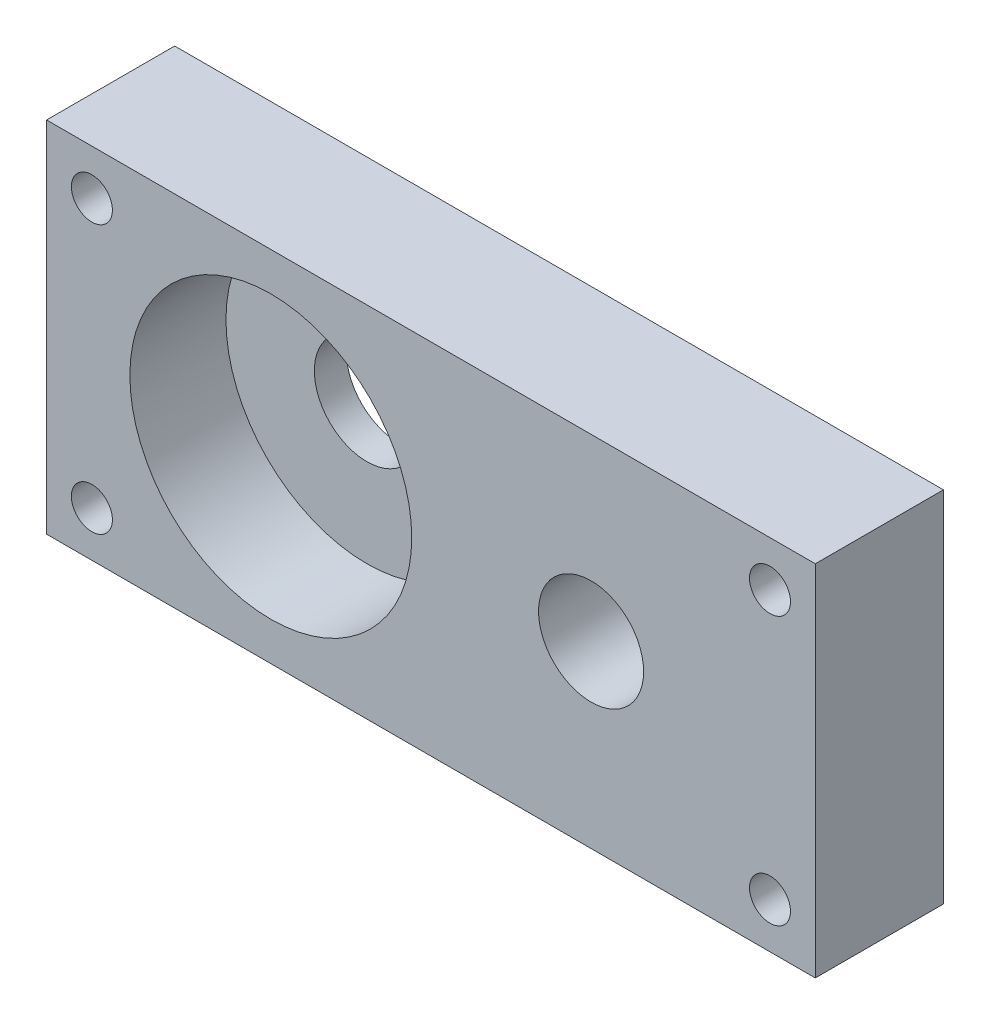
ISO-10303-21;
HEADER;
FILE_DESCRIPTION(('STEP AP214'),'2;1');
FILE_NAME('part.step','',(''),(''),'','','');
FILE_SCHEMA(('AUTOMOTIVE_DESIGN { 1 0 10303 214 1 1 1 1 }'));
ENDSEC;
DATA;
#1=APPLICATION_CONTEXT('core data for automotive mechanical design processes');
#2=APPLICATION_PROTOCOL_DEFINITION('international standard','automotive_design',2000,#1);
#3=PRODUCT_CONTEXT('',#1,'mechanical');
#4=PRODUCT('Part','Part','',(#3));
#5=PRODUCT_RELATED_PRODUCT_CATEGORY('part','',(#4));
#6=PRODUCT_DEFINITION_FORMATION('','',#4);
#7=PRODUCT_DEFINITION_CONTEXT('part definition',#1,'design');
#8=PRODUCT_DEFINITION('design','',#6,#7);
#9=PRODUCT_DEFINITION_SHAPE('','',#8);
#10=(LENGTH_UNIT() NAMED_UNIT(*) SI_UNIT(.MILLI.,.METRE.));
#11=(NAMED_UNIT(*) PLANE_ANGLE_UNIT() SI_UNIT($,.RADIAN.));
#12=(NAMED_UNIT(*) SI_UNIT($,.STERADIAN.) SOLID_ANGLE_UNIT());
#13=UNCERTAINTY_MEASURE_WITH_UNIT(LENGTH_MEASURE(1.E-05),#10,'distance_accuracy_value','');
#14=(GEOMETRIC_REPRESENTATION_CONTEXT(3) GLOBAL_UNCERTAINTY_ASSIGNED_CONTEXT((#13)) GLOBAL_UNIT_ASSIGNED_CONTEXT((#10,
#11,#12)) REPRESENTATION_CONTEXT('',''));
#15=CARTESIAN_POINT('',(0.,0.,0.));
#16=DIRECTION('',(0.,0.,1.));
#17=DIRECTION('',(1.,0.,0.));
#18=AXIS2_PLACEMENT_3D('',#15,#16,#17);
#19=CARTESIAN_POINT('',(-12.5,0.,10.));
#20=DIRECTION('',(0.,0.,-1.));
#21=DIRECTION('',(-1.,0.,0.));
#22=AXIS2_PLACEMENT_3D('',#19,#20,#21);
#23=CYLINDRICAL_SURFACE('',#22,4.1);
#24=CARTESIAN_POINT('',(-12.5,0.,0.));
#25=DIRECTION('',(0.,0.,1.));
#26=DIRECTION('',(1.,0.,0.));
#27=AXIS2_PLACEMENT_3D('',#24,#25,#26);
#28=CIRCLE('',#27,4.1);
#29=CARTESIAN_POINT('',(-8.4,0.,0.));
#30=VERTEX_POINT('',#29);
#31=EDGE_CURVE('E122',#30,#30,#28,.T.);
#32=ORIENTED_EDGE('',*,*,#31,.F.);
#33=EDGE_LOOP('',(#32));
#34=FACE_BOUND('',#33,.T.);
#35=CARTESIAN_POINT('',(-12.5,0.,2.5));
#36=DIRECTION('',(0.,0.,1.));
#37=DIRECTION('',(1.,0.,0.));
#38=AXIS2_PLACEMENT_3D('',#35,#36,#37);
#39=CIRCLE('',#38,4.1);
#40=CARTESIAN_POINT('',(-8.4,0.,2.5));
#41=VERTEX_POINT('',#40);
#42=EDGE_CURVE('E41',#41,#41,#39,.T.);
#43=ORIENTED_EDGE('',*,*,#42,.T.);
#44=EDGE_LOOP('',(#43));
#45=FACE_BOUND('',#44,.T.);
#46=ADVANCED_FACE('F37',(#34,#45),#23,.F.);
#47=CARTESIAN_POINT('',(0.,0.,10.));
#48=DIRECTION('',(0.,0.,1.));
#49=DIRECTION('',(1.,0.,0.));
#50=AXIS2_PLACEMENT_3D('',#47,#48,#49);
#51=PLANE('',#50);
#52=CARTESIAN_POINT('',(-12.5,0.,10.));
#53=DIRECTION('',(0.,0.,1.));
#54=DIRECTION('',(1.,0.,0.));
#55=AXIS2_PLACEMENT_3D('',#52,#53,#54);
#56=CIRCLE('',#55,11.);
#57=CARTESIAN_POINT('',(-1.5,0.,10.));
#58=VERTEX_POINT('',#57);
#59=EDGE_CURVE('E151',#58,#58,#56,.T.);
#60=ORIENTED_EDGE('',*,*,#59,.F.);
#61=EDGE_LOOP('',(#60));
#62=FACE_BOUND('',#61,.T.);
#63=CARTESIAN_POINT('',(26.4644660940674,-10.4644660940672,10.));
#64=DIRECTION('',(0.,0.,1.));
#65=DIRECTION('',(-1.,0.,0.));
#66=AXIS2_PLACEMENT_3D('',#63,#64,#65);
#67=CIRCLE('',#66,1.6);
#68=CARTESIAN_POINT('',(24.8644660940673,-10.4644660940672,10.));
#69=VERTEX_POINT('',#68);
#70=EDGE_CURVE('E137',#69,#69,#67,.T.);
#71=ORIENTED_EDGE('',*,*,#70,.F.);
#72=EDGE_LOOP('',(#71));
#73=FACE_BOUND('',#72,.T.);
#74=CARTESIAN_POINT('',(-26.4644660940673,10.4644660940673,10.));
#75=DIRECTION('',(0.,0.,1.));
#76=DIRECTION('',(1.,0.,0.));
#77=AXIS2_PLACEMENT_3D('',#74,#75,#76);
#78=CIRCLE('',#77,1.6);
#79=CARTESIAN_POINT('',(-24.8644660940673,10.4644660940673,10.));
#80=VERTEX_POINT('',#79);
#81=EDGE_CURVE('E127',#80,#80,#78,.T.);
#82=ORIENTED_EDGE('',*,*,#81,.F.);
#83=EDGE_LOOP('',(#82));
#84=FACE_BOUND('',#83,.T.);
#85=CARTESIAN_POINT('',(12.5,0.,10.));
#86=DIRECTION('',(0.,0.,1.));
#87=DIRECTION('',(1.,0.,0.));
#88=AXIS2_PLACEMENT_3D('',#85,#86,#87);
#89=CIRCLE('',#88,4.1);
#90=CARTESIAN_POINT('',(16.6,0.,10.));
#91=VERTEX_POINT('',#90);
#92=EDGE_CURVE('E107',#91,#91,#89,.T.);
#93=ORIENTED_EDGE('',*,*,#92,.F.);
#94=EDGE_LOOP('',(#93));
#95=FACE_BOUND('',#94,.T.);
#96=DIRECTION('',(0.,-1.,0.));
#97=VECTOR('',#96,1.);
#98=CARTESIAN_POINT('',(-30.,-14.,10.));
#99=LINE('',#98,#97);
#100=CARTESIAN_POINT('',(-30.,14.,10.));
#101=VERTEX_POINT('',#100);
#102=CARTESIAN_POINT('',(-30.,-14.,10.));
#103=VERTEX_POINT('',#102);
#104=EDGE_CURVE('E91',#101,#103,#99,.T.);
#105=ORIENTED_EDGE('',*,*,#104,.T.);
#106=DIRECTION('',(1.,0.,0.));
#107=VECTOR('',#106,1.);
#108=CARTESIAN_POINT('',(30.,-14.,10.));
#109=LINE('',#108,#107);
#110=CARTESIAN_POINT('',(30.,-14.,10.));
#111=VERTEX_POINT('',#110);
#112=EDGE_CURVE('E85',#103,#111,#109,.T.);
#113=ORIENTED_EDGE('',*,*,#112,.T.);
#114=DIRECTION('',(0.,1.,0.));
#115=VECTOR('',#114,1.);
#116=CARTESIAN_POINT('',(30.,-14.,10.));
#117=LINE('',#116,#115);
#118=CARTESIAN_POINT('',(30.,14.,10.));
#119=VERTEX_POINT('',#118);
#120=EDGE_CURVE('E89',#111,#119,#117,.T.);
#121=ORIENTED_EDGE('',*,*,#120,.T.);
#122=DIRECTION('',(-1.,0.,0.));
#123=VECTOR('',#122,1.);
#124=CARTESIAN_POINT('',(30.,14.,10.));
#125=LINE('',#124,#123);
#126=EDGE_CURVE('E55',#119,#101,#125,.T.);
#127=ORIENTED_EDGE('',*,*,#126,.T.);
#128=EDGE_LOOP('',(#105,#113,#121,#127));
#129=FACE_BOUND('',#128,.T.);
#130=CARTESIAN_POINT('',(-26.4644660940673,-10.4644660940673,10.));
#131=DIRECTION('',(0.,0.,1.));
#132=DIRECTION('',(1.,0.,0.));
#133=AXIS2_PLACEMENT_3D('',#130,#131,#132);
#134=CIRCLE('',#133,1.6);
#135=CARTESIAN_POINT('',(-24.8644660940673,-10.4644660940673,10.));
#136=VERTEX_POINT('',#135);
#137=EDGE_CURVE('E131',#136,#136,#134,.T.);
#138=ORIENTED_EDGE('',*,*,#137,.F.);
#139=EDGE_LOOP('',(#138));
#140=FACE_BOUND('',#139,.T.);
#141=CARTESIAN_POINT('',(26.4644660940673,10.4644660940674,10.));
#142=DIRECTION('',(0.,0.,1.));
#143=DIRECTION('',(-1.,0.,0.));
#144=AXIS2_PLACEMENT_3D('',#141,#142,#143);
#145=CIRCLE('',#144,1.6);
#146=CARTESIAN_POINT('',(24.8644660940673,10.4644660940674,10.));
#147=VERTEX_POINT('',#146);
#148=EDGE_CURVE('E143',#147,#147,#145,.T.);
#149=ORIENTED_EDGE('',*,*,#148,.F.);
#150=EDGE_LOOP('',(#149));
#151=FACE_BOUND('',#150,.T.);
#152=ADVANCED_FACE('F86',(#62,#73,#84,#95,#129,#140,#151),#51,.T.);
#153=CARTESIAN_POINT('',(0.,0.,0.));
#154=DIRECTION('',(0.,0.,1.));
#155=DIRECTION('',(1.,0.,0.));
#156=AXIS2_PLACEMENT_3D('',#153,#154,#155);
#157=PLANE('',#156);
#158=DIRECTION('',(0.,-1.,0.));
#159=VECTOR('',#158,1.);
#160=CARTESIAN_POINT('',(-30.,-14.,0.));
#161=LINE('',#160,#159);
#162=CARTESIAN_POINT('',(-30.,14.,0.));
#163=VERTEX_POINT('',#162);
#164=CARTESIAN_POINT('',(-30.,-14.,0.));
#165=VERTEX_POINT('',#164);
#166=EDGE_CURVE('E104',#163,#165,#161,.T.);
#167=ORIENTED_EDGE('',*,*,#166,.F.);
#168=DIRECTION('',(-1.,0.,0.));
#169=VECTOR('',#168,1.);
#170=CARTESIAN_POINT('',(30.,14.,0.));
#171=LINE('',#170,#169);
#172=CARTESIAN_POINT('',(30.,14.,0.));
#173=VERTEX_POINT('',#172);
#174=EDGE_CURVE('E78',#173,#163,#171,.T.);
#175=ORIENTED_EDGE('',*,*,#174,.F.);
#176=DIRECTION('',(0.,1.,0.));
#177=VECTOR('',#176,1.);
#178=CARTESIAN_POINT('',(30.,-14.,0.));
#179=LINE('',#178,#177);
#180=CARTESIAN_POINT('',(30.,-14.,0.));
#181=VERTEX_POINT('',#180);
#182=EDGE_CURVE('E72',#181,#173,#179,.T.);
#183=ORIENTED_EDGE('',*,*,#182,.F.);
#184=DIRECTION('',(1.,0.,0.));
#185=VECTOR('',#184,1.);
#186=CARTESIAN_POINT('',(30.,-14.,0.));
#187=LINE('',#186,#185);
#188=EDGE_CURVE('E95',#165,#181,#187,.T.);
#189=ORIENTED_EDGE('',*,*,#188,.F.);
#190=EDGE_LOOP('',(#167,#175,#183,#189));
#191=FACE_BOUND('',#190,.T.);
#192=CARTESIAN_POINT('',(12.5,0.,0.));
#193=DIRECTION('',(0.,0.,1.));
#194=DIRECTION('',(1.,0.,0.));
#195=AXIS2_PLACEMENT_3D('',#192,#193,#194);
#196=CIRCLE('',#195,4.1);
#197=CARTESIAN_POINT('',(16.6,0.,0.));
#198=VERTEX_POINT('',#197);
#199=EDGE_CURVE('E119',#198,#198,#196,.T.);
#200=ORIENTED_EDGE('',*,*,#199,.T.);
#201=EDGE_LOOP('',(#200));
#202=FACE_BOUND('',#201,.T.);
#203=ORIENTED_EDGE('',*,*,#31,.T.);
#204=EDGE_LOOP('',(#203));
#205=FACE_BOUND('',#204,.T.);
#206=CARTESIAN_POINT('',(-26.4644660940673,10.4644660940673,0.));
#207=DIRECTION('',(0.,0.,1.));
#208=DIRECTION('',(1.,0.,0.));
#209=AXIS2_PLACEMENT_3D('',#206,#207,#208);
#210=CIRCLE('',#209,1.6);
#211=CARTESIAN_POINT('',(-24.8644660940673,10.4644660940673,0.));
#212=VERTEX_POINT('',#211);
#213=EDGE_CURVE('E128',#212,#212,#210,.T.);
#214=ORIENTED_EDGE('',*,*,#213,.T.);
#215=EDGE_LOOP('',(#214));
#216=FACE_BOUND('',#215,.T.);
#217=CARTESIAN_POINT('',(-26.4644660940673,-10.4644660940673,0.));
#218=DIRECTION('',(0.,0.,1.));
#219=DIRECTION('',(1.,0.,0.));
#220=AXIS2_PLACEMENT_3D('',#217,#218,#219);
#221=CIRCLE('',#220,1.6);
#222=CARTESIAN_POINT('',(-24.8644660940673,-10.4644660940673,0.));
#223=VERTEX_POINT('',#222);
#224=EDGE_CURVE('E134',#223,#223,#221,.T.);
#225=ORIENTED_EDGE('',*,*,#224,.T.);
#226=EDGE_LOOP('',(#225));
#227=FACE_BOUND('',#226,.T.);
#228=CARTESIAN_POINT('',(26.4644660940674,-10.4644660940672,0.));
#229=DIRECTION('',(0.,0.,1.));
#230=DIRECTION('',(-1.,0.,0.));
#231=AXIS2_PLACEMENT_3D('',#228,#229,#230);
#232=CIRCLE('',#231,1.6);
#233=CARTESIAN_POINT('',(24.8644660940673,-10.4644660940672,0.));
#234=VERTEX_POINT('',#233);
#235=EDGE_CURVE('E140',#234,#234,#232,.T.);
#236=ORIENTED_EDGE('',*,*,#235,.T.);
#237=EDGE_LOOP('',(#236));
#238=FACE_BOUND('',#237,.T.);
#239=CARTESIAN_POINT('',(26.4644660940673,10.4644660940674,0.));
#240=DIRECTION('',(0.,0.,1.));
#241=DIRECTION('',(-1.,0.,0.));
#242=AXIS2_PLACEMENT_3D('',#239,#240,#241);
#243=CIRCLE('',#242,1.6);
#244=CARTESIAN_POINT('',(24.8644660940673,10.4644660940674,0.));
#245=VERTEX_POINT('',#244);
#246=EDGE_CURVE('E146',#245,#245,#243,.T.);
#247=ORIENTED_EDGE('',*,*,#246,.T.);
#248=EDGE_LOOP('',(#247));
#249=FACE_BOUND('',#248,.T.);
#250=ADVANCED_FACE('F115',(#191,#202,#205,#216,#227,#238,#249),#157,.F.);
#251=CARTESIAN_POINT('',(-30.,-14.,10.));
#252=DIRECTION('',(1.,0.,0.));
#253=DIRECTION('',(0.,0.,-1.));
#254=AXIS2_PLACEMENT_3D('',#251,#252,#253);
#255=PLANE('',#254);
#256=ORIENTED_EDGE('',*,*,#166,.T.);
#257=DIRECTION('',(0.,0.,-1.));
#258=VECTOR('',#257,1.);
#259=CARTESIAN_POINT('',(-30.,-14.,10.));
#260=LINE('',#259,#258);
#261=EDGE_CURVE('E11',#103,#165,#260,.T.);
#262=ORIENTED_EDGE('',*,*,#261,.F.);
#263=ORIENTED_EDGE('',*,*,#104,.F.);
#264=DIRECTION('',(0.,0.,-1.));
#265=VECTOR('',#264,1.);
#266=CARTESIAN_POINT('',(-30.,14.,10.));
#267=LINE('',#266,#265);
#268=EDGE_CURVE('E100',#101,#163,#267,.T.);
#269=ORIENTED_EDGE('',*,*,#268,.T.);
#270=EDGE_LOOP('',(#256,#262,#263,#269));
#271=FACE_BOUND('',#270,.T.);
#272=ADVANCED_FACE('F39',(#271),#255,.F.);
#273=CARTESIAN_POINT('',(30.,-14.,10.));
#274=DIRECTION('',(0.,1.,0.));
#275=DIRECTION('',(-1.,0.,0.));
#276=AXIS2_PLACEMENT_3D('',#273,#274,#275);
#277=PLANE('',#276);
#278=ORIENTED_EDGE('',*,*,#188,.T.);
#279=DIRECTION('',(0.,0.,-1.));
#280=VECTOR('',#279,1.);
#281=CARTESIAN_POINT('',(30.,-14.,10.));
#282=LINE('',#281,#280);
#283=EDGE_CURVE('E47',#111,#181,#282,.T.);
#284=ORIENTED_EDGE('',*,*,#283,.F.);
#285=ORIENTED_EDGE('',*,*,#112,.F.);
#286=ORIENTED_EDGE('',*,*,#261,.T.);
#287=EDGE_LOOP('',(#278,#284,#285,#286));
#288=FACE_BOUND('',#287,.T.);
#289=ADVANCED_FACE('F94',(#288),#277,.F.);
#290=CARTESIAN_POINT('',(30.,-14.,10.));
#291=DIRECTION('',(-1.,0.,0.));
#292=DIRECTION('',(0.,0.,1.));
#293=AXIS2_PLACEMENT_3D('',#290,#291,#292);
#294=PLANE('',#293);
#295=ORIENTED_EDGE('',*,*,#182,.T.);
#296=DIRECTION('',(0.,0.,-1.));
#297=VECTOR('',#296,1.);
#298=CARTESIAN_POINT('',(30.,14.,10.));
#299=LINE('',#298,#297);
#300=EDGE_CURVE('E96',#119,#173,#299,.T.);
#301=ORIENTED_EDGE('',*,*,#300,.F.);
#302=ORIENTED_EDGE('',*,*,#120,.F.);
#303=ORIENTED_EDGE('',*,*,#283,.T.);
#304=EDGE_LOOP('',(#295,#301,#302,#303));
#305=FACE_BOUND('',#304,.T.);
#306=ADVANCED_FACE('F98',(#305),#294,.F.);
#307=CARTESIAN_POINT('',(30.,14.,10.));
#308=DIRECTION('',(0.,-1.,0.));
#309=DIRECTION('',(1.,0.,0.));
#310=AXIS2_PLACEMENT_3D('',#307,#308,#309);
#311=PLANE('',#310);
#312=ORIENTED_EDGE('',*,*,#174,.T.);
#313=ORIENTED_EDGE('',*,*,#268,.F.);
#314=ORIENTED_EDGE('',*,*,#126,.F.);
#315=ORIENTED_EDGE('',*,*,#300,.T.);
#316=EDGE_LOOP('',(#312,#313,#314,#315));
#317=FACE_BOUND('',#316,.T.);
#318=ADVANCED_FACE('F112',(#317),#311,.F.);
#319=CARTESIAN_POINT('',(12.5,0.,10.));
#320=DIRECTION('',(0.,0.,-1.));
#321=DIRECTION('',(-1.,0.,0.));
#322=AXIS2_PLACEMENT_3D('',#319,#320,#321);
#323=CYLINDRICAL_SURFACE('',#322,4.1);
#324=ORIENTED_EDGE('',*,*,#92,.T.);
#325=EDGE_LOOP('',(#324));
#326=FACE_BOUND('',#325,.T.);
#327=ORIENTED_EDGE('',*,*,#199,.F.);
#328=EDGE_LOOP('',(#327));
#329=FACE_BOUND('',#328,.T.);
#330=ADVANCED_FACE('F185',(#326,#329),#323,.F.);
#331=CARTESIAN_POINT('',(-26.4644660940673,10.4644660940673,10.));
#332=DIRECTION('',(0.,0.,-1.));
#333=DIRECTION('',(-1.,0.,0.));
#334=AXIS2_PLACEMENT_3D('',#331,#332,#333);
#335=CYLINDRICAL_SURFACE('',#334,1.6);
#336=ORIENTED_EDGE('',*,*,#81,.T.);
#337=EDGE_LOOP('',(#336));
#338=FACE_BOUND('',#337,.T.);
#339=ORIENTED_EDGE('',*,*,#213,.F.);
#340=EDGE_LOOP('',(#339));
#341=FACE_BOUND('',#340,.T.);
#342=ADVANCED_FACE('F183',(#338,#341),#335,.F.);
#343=CARTESIAN_POINT('',(-26.4644660940673,-10.4644660940673,10.));
#344=DIRECTION('',(0.,0.,-1.));
#345=DIRECTION('',(-1.,0.,0.));
#346=AXIS2_PLACEMENT_3D('',#343,#344,#345);
#347=CYLINDRICAL_SURFACE('',#346,1.6);
#348=ORIENTED_EDGE('',*,*,#137,.T.);
#349=EDGE_LOOP('',(#348));
#350=FACE_BOUND('',#349,.T.);
#351=ORIENTED_EDGE('',*,*,#224,.F.);
#352=EDGE_LOOP('',(#351));
#353=FACE_BOUND('',#352,.T.);
#354=ADVANCED_FACE('F236',(#350,#353),#347,.F.);
#355=CARTESIAN_POINT('',(26.4644660940674,-10.4644660940672,10.));
#356=DIRECTION('',(0.,0.,-1.));
#357=DIRECTION('',(-1.,0.,0.));
#358=AXIS2_PLACEMENT_3D('',#355,#356,#357);
#359=CYLINDRICAL_SURFACE('',#358,1.6);
#360=ORIENTED_EDGE('',*,*,#70,.T.);
#361=EDGE_LOOP('',(#360));
#362=FACE_BOUND('',#361,.T.);
#363=ORIENTED_EDGE('',*,*,#235,.F.);
#364=EDGE_LOOP('',(#363));
#365=FACE_BOUND('',#364,.T.);
#366=ADVANCED_FACE('F228',(#362,#365),#359,.F.);
#367=CARTESIAN_POINT('',(26.4644660940673,10.4644660940674,10.));
#368=DIRECTION('',(0.,0.,-1.));
#369=DIRECTION('',(-1.,0.,0.));
#370=AXIS2_PLACEMENT_3D('',#367,#368,#369);
#371=CYLINDRICAL_SURFACE('',#370,1.6);
#372=ORIENTED_EDGE('',*,*,#148,.T.);
#373=EDGE_LOOP('',(#372));
#374=FACE_BOUND('',#373,.T.);
#375=ORIENTED_EDGE('',*,*,#246,.F.);
#376=EDGE_LOOP('',(#375));
#377=FACE_BOUND('',#376,.T.);
#378=ADVANCED_FACE('F169',(#374,#377),#371,.F.);
#379=CARTESIAN_POINT('',(-12.5,0.,2.5));
#380=DIRECTION('',(0.,0.,1.));
#381=DIRECTION('',(1.,0.,0.));
#382=AXIS2_PLACEMENT_3D('',#379,#380,#381);
#383=CYLINDRICAL_SURFACE('',#382,11.);
#384=CARTESIAN_POINT('',(-12.5,0.,2.5));
#385=DIRECTION('',(0.,0.,1.));
#386=DIRECTION('',(1.,0.,0.));
#387=AXIS2_PLACEMENT_3D('',#384,#385,#386);
#388=CIRCLE('',#387,11.);
#389=CARTESIAN_POINT('',(-1.5,0.,2.5));
#390=VERTEX_POINT('',#389);
#391=EDGE_CURVE('E154',#390,#390,#388,.T.);
#392=ORIENTED_EDGE('',*,*,#391,.F.);
#393=EDGE_LOOP('',(#392));
#394=FACE_BOUND('',#393,.T.);
#395=ORIENTED_EDGE('',*,*,#59,.T.);
#396=EDGE_LOOP('',(#395));
#397=FACE_BOUND('',#396,.T.);
#398=ADVANCED_FACE('F164',(#394,#397),#383,.F.);
#399=CARTESIAN_POINT('',(-12.5,0.,2.5));
#400=DIRECTION('',(0.,0.,1.));
#401=DIRECTION('',(1.,0.,0.));
#402=AXIS2_PLACEMENT_3D('',#399,#400,#401);
#403=PLANE('',#402);
#404=ORIENTED_EDGE('',*,*,#42,.F.);
#405=EDGE_LOOP('',(#404));
#406=FACE_BOUND('',#405,.T.);
#407=ORIENTED_EDGE('',*,*,#391,.T.);
#408=EDGE_LOOP('',(#407));
#409=FACE_BOUND('',#408,.T.);
#410=ADVANCED_FACE('F162',(#406,#409),#403,.T.);
#411=CLOSED_SHELL('',(#46,#152,#250,#272,#289,#306,#318,#330,#342,#354,#366,#378,#398,#410));
#412=MANIFOLD_SOLID_BREP('B2',#411);
#413=ADVANCED_BREP_SHAPE_REPRESENTATION('',(#18,#412),#14);
#414=SHAPE_DEFINITION_REPRESENTATION(#9,#413);
ENDSEC;
END-ISO-10303-21;
